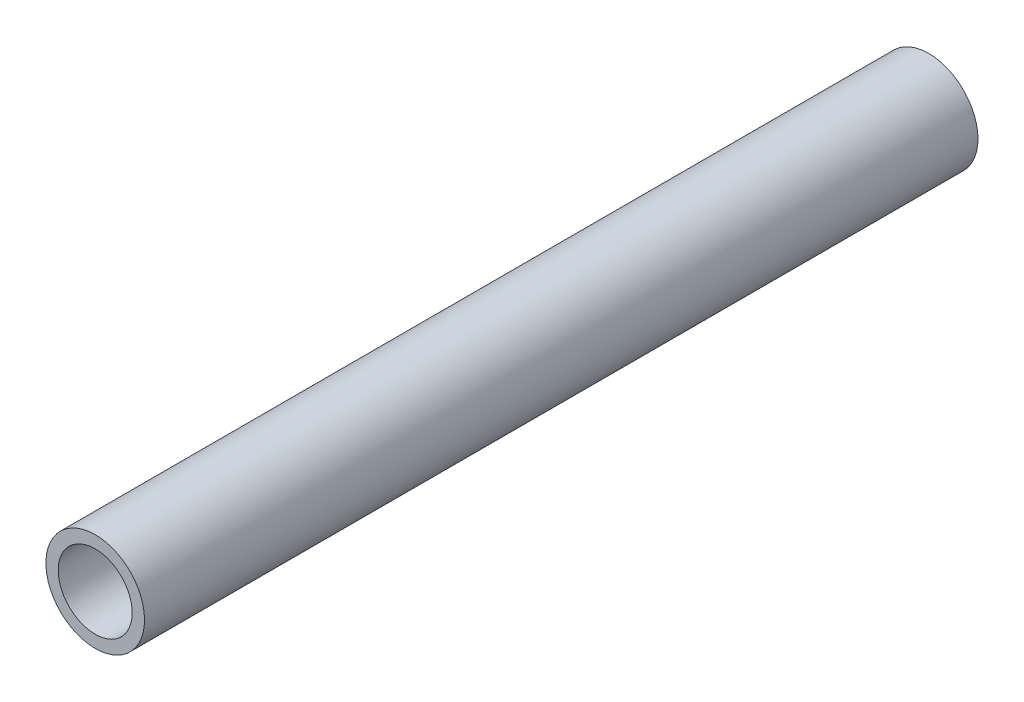
ISO-10303-21;
HEADER;
FILE_DESCRIPTION(('STEP AP214'),'2;1');
FILE_NAME('part.step','',(''),(''),'','','');
FILE_SCHEMA(('AUTOMOTIVE_DESIGN { 1 0 10303 214 1 1 1 1 }'));
ENDSEC;
DATA;
#1=APPLICATION_CONTEXT('core data for automotive mechanical design processes');
#2=APPLICATION_PROTOCOL_DEFINITION('international standard','automotive_design',2000,#1);
#3=PRODUCT_CONTEXT('',#1,'mechanical');
#4=PRODUCT('Part','Part','',(#3));
#5=PRODUCT_RELATED_PRODUCT_CATEGORY('part','',(#4));
#6=PRODUCT_DEFINITION_FORMATION('','',#4);
#7=PRODUCT_DEFINITION_CONTEXT('part definition',#1,'design');
#8=PRODUCT_DEFINITION('design','',#6,#7);
#9=PRODUCT_DEFINITION_SHAPE('','',#8);
#10=(LENGTH_UNIT() NAMED_UNIT(*) SI_UNIT(.MILLI.,.METRE.));
#11=(NAMED_UNIT(*) PLANE_ANGLE_UNIT() SI_UNIT($,.RADIAN.));
#12=(NAMED_UNIT(*) SI_UNIT($,.STERADIAN.) SOLID_ANGLE_UNIT());
#13=UNCERTAINTY_MEASURE_WITH_UNIT(LENGTH_MEASURE(1.E-05),#10,'distance_accuracy_value','');
#14=(GEOMETRIC_REPRESENTATION_CONTEXT(3) GLOBAL_UNCERTAINTY_ASSIGNED_CONTEXT((#13)) GLOBAL_UNIT_ASSIGNED_CONTEXT((#10,
#11,#12)) REPRESENTATION_CONTEXT('',''));
#15=CARTESIAN_POINT('',(0.,0.,0.));
#16=DIRECTION('',(0.,0.,1.));
#17=DIRECTION('',(1.,0.,0.));
#18=AXIS2_PLACEMENT_3D('',#15,#16,#17);
#19=CARTESIAN_POINT('',(0.,0.,107.34675));
#20=DIRECTION('',(0.,0.,1.));
#21=DIRECTION('',(1.,0.,0.));
#22=AXIS2_PLACEMENT_3D('',#19,#20,#21);
#23=PLANE('',#22);
#24=CARTESIAN_POINT('',(0.,0.,107.34675));
#25=DIRECTION('',(0.,0.,1.));
#26=DIRECTION('',(1.,0.,0.));
#27=AXIS2_PLACEMENT_3D('',#24,#25,#26);
#28=CIRCLE('',#27,12.7);
#29=CARTESIAN_POINT('',(12.7,0.,107.34675));
#30=VERTEX_POINT('',#29);
#31=EDGE_CURVE('E10',#30,#30,#28,.T.);
#32=ORIENTED_EDGE('',*,*,#31,.T.);
#33=EDGE_LOOP('',(#32));
#34=FACE_BOUND('',#33,.T.);
#35=CARTESIAN_POINT('',(0.,0.,107.34675));
#36=DIRECTION('',(0.,0.,1.));
#37=DIRECTION('',(1.,0.,0.));
#38=AXIS2_PLACEMENT_3D('',#35,#36,#37);
#39=CIRCLE('',#38,9.525);
#40=CARTESIAN_POINT('',(9.525,0.,107.34675));
#41=VERTEX_POINT('',#40);
#42=EDGE_CURVE('E43',#41,#41,#39,.T.);
#43=ORIENTED_EDGE('',*,*,#42,.F.);
#44=EDGE_LOOP('',(#43));
#45=FACE_BOUND('',#44,.T.);
#46=ADVANCED_FACE('F32',(#34,#45),#23,.T.);
#47=CARTESIAN_POINT('',(0.,0.,-107.34675));
#48=DIRECTION('',(0.,0.,1.));
#49=DIRECTION('',(1.,0.,0.));
#50=AXIS2_PLACEMENT_3D('',#47,#48,#49);
#51=PLANE('',#50);
#52=CARTESIAN_POINT('',(0.,0.,-107.34675));
#53=DIRECTION('',(0.,0.,1.));
#54=DIRECTION('',(1.,0.,0.));
#55=AXIS2_PLACEMENT_3D('',#52,#53,#54);
#56=CIRCLE('',#55,12.7);
#57=CARTESIAN_POINT('',(12.7,0.,-107.34675));
#58=VERTEX_POINT('',#57);
#59=EDGE_CURVE('E36',#58,#58,#56,.T.);
#60=ORIENTED_EDGE('',*,*,#59,.F.);
#61=EDGE_LOOP('',(#60));
#62=FACE_BOUND('',#61,.T.);
#63=CARTESIAN_POINT('',(0.,0.,-107.34675));
#64=DIRECTION('',(0.,0.,1.));
#65=DIRECTION('',(1.,0.,0.));
#66=AXIS2_PLACEMENT_3D('',#63,#64,#65);
#67=CIRCLE('',#66,9.525);
#68=CARTESIAN_POINT('',(9.525,0.,-107.34675));
#69=VERTEX_POINT('',#68);
#70=EDGE_CURVE('E45',#69,#69,#67,.T.);
#71=ORIENTED_EDGE('',*,*,#70,.T.);
#72=EDGE_LOOP('',(#71));
#73=FACE_BOUND('',#72,.T.);
#74=ADVANCED_FACE('F55',(#62,#73),#51,.F.);
#75=CARTESIAN_POINT('',(0.,0.,107.34675));
#76=DIRECTION('',(0.,0.,-1.));
#77=DIRECTION('',(-1.,0.,0.));
#78=AXIS2_PLACEMENT_3D('',#75,#76,#77);
#79=CYLINDRICAL_SURFACE('',#78,12.7);
#80=ORIENTED_EDGE('',*,*,#31,.F.);
#81=EDGE_LOOP('',(#80));
#82=FACE_BOUND('',#81,.T.);
#83=ORIENTED_EDGE('',*,*,#59,.T.);
#84=EDGE_LOOP('',(#83));
#85=FACE_BOUND('',#84,.T.);
#86=ADVANCED_FACE('F34',(#82,#85),#79,.T.);
#87=CARTESIAN_POINT('',(0.,0.,107.34675));
#88=DIRECTION('',(0.,0.,-1.));
#89=DIRECTION('',(-1.,0.,0.));
#90=AXIS2_PLACEMENT_3D('',#87,#88,#89);
#91=CYLINDRICAL_SURFACE('',#90,9.525);
#92=ORIENTED_EDGE('',*,*,#42,.T.);
#93=EDGE_LOOP('',(#92));
#94=FACE_BOUND('',#93,.T.);
#95=ORIENTED_EDGE('',*,*,#70,.F.);
#96=EDGE_LOOP('',(#95));
#97=FACE_BOUND('',#96,.T.);
#98=ADVANCED_FACE('F51',(#94,#97),#91,.F.);
#99=CLOSED_SHELL('',(#46,#74,#86,#98));
#100=MANIFOLD_SOLID_BREP('B2',#99);
#101=ADVANCED_BREP_SHAPE_REPRESENTATION('',(#18,#100),#14);
#102=SHAPE_DEFINITION_REPRESENTATION(#9,#101);
ENDSEC;
END-ISO-10303-21;
